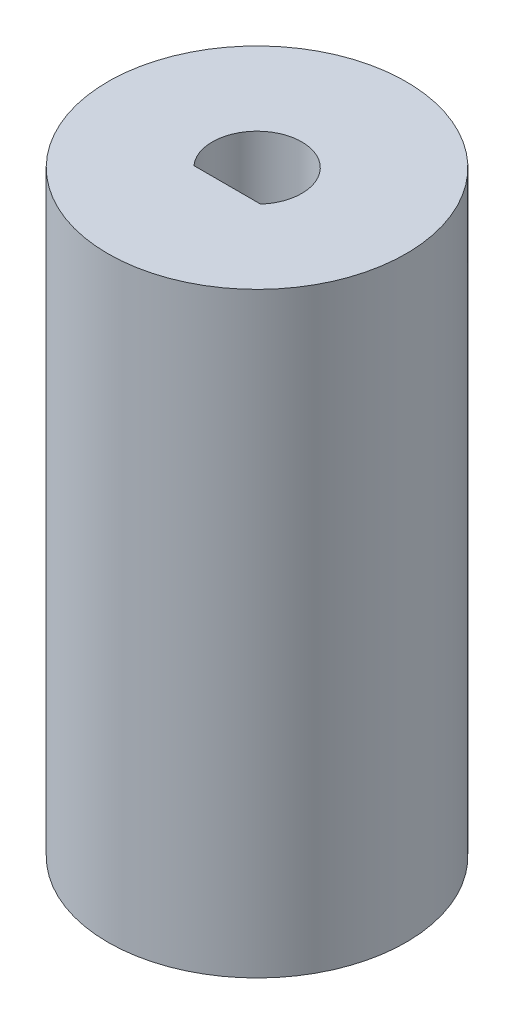
ISO-10303-21;
HEADER;
FILE_DESCRIPTION(('STEP AP214'),'2;1');
FILE_NAME('part.step','',(''),(''),'','','');
FILE_SCHEMA(('AUTOMOTIVE_DESIGN { 1 0 10303 214 1 1 1 1 }'));
ENDSEC;
DATA;
#1=APPLICATION_CONTEXT('core data for automotive mechanical design processes');
#2=APPLICATION_PROTOCOL_DEFINITION('international standard','automotive_design',2000,#1);
#3=PRODUCT_CONTEXT('',#1,'mechanical');
#4=PRODUCT('Part','Part','',(#3));
#5=PRODUCT_RELATED_PRODUCT_CATEGORY('part','',(#4));
#6=PRODUCT_DEFINITION_FORMATION('','',#4);
#7=PRODUCT_DEFINITION_CONTEXT('part definition',#1,'design');
#8=PRODUCT_DEFINITION('design','',#6,#7);
#9=PRODUCT_DEFINITION_SHAPE('','',#8);
#10=(LENGTH_UNIT() NAMED_UNIT(*) SI_UNIT(.MILLI.,.METRE.));
#11=(NAMED_UNIT(*) PLANE_ANGLE_UNIT() SI_UNIT($,.RADIAN.));
#12=(NAMED_UNIT(*) SI_UNIT($,.STERADIAN.) SOLID_ANGLE_UNIT());
#13=UNCERTAINTY_MEASURE_WITH_UNIT(LENGTH_MEASURE(1.E-05),#10,'distance_accuracy_value','');
#14=(GEOMETRIC_REPRESENTATION_CONTEXT(3) GLOBAL_UNCERTAINTY_ASSIGNED_CONTEXT((#13)) GLOBAL_UNIT_ASSIGNED_CONTEXT((#10,
#11,#12)) REPRESENTATION_CONTEXT('',''));
#15=CARTESIAN_POINT('',(0.,0.,0.));
#16=DIRECTION('',(0.,0.,1.));
#17=DIRECTION('',(1.,0.,0.));
#18=AXIS2_PLACEMENT_3D('',#15,#16,#17);
#19=CARTESIAN_POINT('',(0.,40.,0.));
#20=DIRECTION('',(0.,-1.,0.));
#21=DIRECTION('',(0.,0.,-1.));
#22=AXIS2_PLACEMENT_3D('',#19,#20,#21);
#23=CYLINDRICAL_SURFACE('',#22,10.);
#24=CARTESIAN_POINT('',(0.,40.,0.));
#25=DIRECTION('',(0.,1.,0.));
#26=DIRECTION('',(0.,0.,1.));
#27=AXIS2_PLACEMENT_3D('',#24,#25,#26);
#28=CIRCLE('',#27,10.);
#29=CARTESIAN_POINT('',(0.,40.,10.));
#30=VERTEX_POINT('',#29);
#31=EDGE_CURVE('E11',#30,#30,#28,.T.);
#32=ORIENTED_EDGE('',*,*,#31,.F.);
#33=EDGE_LOOP('',(#32));
#34=FACE_BOUND('',#33,.T.);
#35=CARTESIAN_POINT('',(0.,0.,0.));
#36=DIRECTION('',(0.,1.,0.));
#37=DIRECTION('',(0.,0.,1.));
#38=AXIS2_PLACEMENT_3D('',#35,#36,#37);
#39=CIRCLE('',#38,10.);
#40=CARTESIAN_POINT('',(0.,0.,10.));
#41=VERTEX_POINT('',#40);
#42=EDGE_CURVE('E35',#41,#41,#39,.T.);
#43=ORIENTED_EDGE('',*,*,#42,.T.);
#44=EDGE_LOOP('',(#43));
#45=FACE_BOUND('',#44,.T.);
#46=ADVANCED_FACE('F32',(#34,#45),#23,.T.);
#47=CARTESIAN_POINT('',(0.,40.,0.));
#48=DIRECTION('',(0.,1.,0.));
#49=DIRECTION('',(0.,0.,1.));
#50=AXIS2_PLACEMENT_3D('',#47,#48,#49);
#51=PLANE('',#50);
#52=CARTESIAN_POINT('',(1.80411241501588E-13,40.,0.));
#53=DIRECTION('',(0.,1.,0.));
#54=DIRECTION('',(0.,0.,1.));
#55=AXIS2_PLACEMENT_3D('',#52,#53,#54);
#56=CIRCLE('',#55,2.99999999999987);
#57=CARTESIAN_POINT('',(2.23606797749961,40.,2.));
#58=VERTEX_POINT('',#57);
#59=CARTESIAN_POINT('',(-2.23606797749961,40.,2.));
#60=VERTEX_POINT('',#59);
#61=EDGE_CURVE('E46',#58,#60,#56,.T.);
#62=ORIENTED_EDGE('',*,*,#61,.F.);
#63=DIRECTION('',(1.,0.,0.));
#64=VECTOR('',#63,1.);
#65=CARTESIAN_POINT('',(2.23606797749961,40.,2.));
#66=LINE('',#65,#64);
#67=EDGE_CURVE('E65',#60,#58,#66,.T.);
#68=ORIENTED_EDGE('',*,*,#67,.F.);
#69=EDGE_LOOP('',(#62,#68));
#70=FACE_BOUND('',#69,.T.);
#71=ORIENTED_EDGE('',*,*,#31,.T.);
#72=EDGE_LOOP('',(#71));
#73=FACE_BOUND('',#72,.T.);
#74=ADVANCED_FACE('F69',(#70,#73),#51,.T.);
#75=CARTESIAN_POINT('',(0.,0.,0.));
#76=DIRECTION('',(0.,1.,0.));
#77=DIRECTION('',(0.,0.,1.));
#78=AXIS2_PLACEMENT_3D('',#75,#76,#77);
#79=PLANE('',#78);
#80=ORIENTED_EDGE('',*,*,#42,.F.);
#81=EDGE_LOOP('',(#80));
#82=FACE_BOUND('',#81,.T.);
#83=ADVANCED_FACE('F89',(#82),#79,.F.);
#84=CARTESIAN_POINT('',(1.80411241501588E-13,30.,0.));
#85=DIRECTION('',(0.,1.,0.));
#86=DIRECTION('',(0.,0.,1.));
#87=AXIS2_PLACEMENT_3D('',#84,#85,#86);
#88=CYLINDRICAL_SURFACE('',#87,2.99999999999987);
#89=ORIENTED_EDGE('',*,*,#61,.T.);
#90=DIRECTION('',(0.,1.,0.));
#91=VECTOR('',#90,1.);
#92=CARTESIAN_POINT('',(-2.23606797749961,30.,2.));
#93=LINE('',#92,#91);
#94=CARTESIAN_POINT('',(-2.23606797749961,30.,2.));
#95=VERTEX_POINT('',#94);
#96=EDGE_CURVE('E62',#95,#60,#93,.T.);
#97=ORIENTED_EDGE('',*,*,#96,.F.);
#98=CARTESIAN_POINT('',(1.80411241501588E-13,30.,0.));
#99=DIRECTION('',(0.,1.,0.));
#100=DIRECTION('',(0.,0.,1.));
#101=AXIS2_PLACEMENT_3D('',#98,#99,#100);
#102=CIRCLE('',#101,2.99999999999987);
#103=CARTESIAN_POINT('',(2.23606797749961,30.,2.));
#104=VERTEX_POINT('',#103);
#105=EDGE_CURVE('E60',#104,#95,#102,.T.);
#106=ORIENTED_EDGE('',*,*,#105,.F.);
#107=DIRECTION('',(0.,1.,0.));
#108=VECTOR('',#107,1.);
#109=CARTESIAN_POINT('',(2.23606797749961,30.,2.));
#110=LINE('',#109,#108);
#111=EDGE_CURVE('E54',#104,#58,#110,.T.);
#112=ORIENTED_EDGE('',*,*,#111,.T.);
#113=EDGE_LOOP('',(#89,#97,#106,#112));
#114=FACE_BOUND('',#113,.T.);
#115=ADVANCED_FACE('F58',(#114),#88,.F.);
#116=CARTESIAN_POINT('',(2.23606797749961,30.,2.));
#117=DIRECTION('',(0.,0.,1.));
#118=DIRECTION('',(1.,0.,0.));
#119=AXIS2_PLACEMENT_3D('',#116,#117,#118);
#120=PLANE('',#119);
#121=ORIENTED_EDGE('',*,*,#67,.T.);
#122=ORIENTED_EDGE('',*,*,#111,.F.);
#123=DIRECTION('',(1.,0.,0.));
#124=VECTOR('',#123,1.);
#125=CARTESIAN_POINT('',(2.23606797749961,30.,2.));
#126=LINE('',#125,#124);
#127=EDGE_CURVE('E73',#95,#104,#126,.T.);
#128=ORIENTED_EDGE('',*,*,#127,.F.);
#129=ORIENTED_EDGE('',*,*,#96,.T.);
#130=EDGE_LOOP('',(#121,#122,#128,#129));
#131=FACE_BOUND('',#130,.T.);
#132=ADVANCED_FACE('F66',(#131),#120,.F.);
#133=CARTESIAN_POINT('',(1.80411241501588E-13,30.,0.));
#134=DIRECTION('',(0.,1.,0.));
#135=DIRECTION('',(0.,0.,1.));
#136=AXIS2_PLACEMENT_3D('',#133,#134,#135);
#137=PLANE('',#136);
#138=ORIENTED_EDGE('',*,*,#105,.T.);
#139=ORIENTED_EDGE('',*,*,#127,.T.);
#140=EDGE_LOOP('',(#138,#139));
#141=FACE_BOUND('',#140,.T.);
#142=ADVANCED_FACE('F77',(#141),#137,.T.);
#143=CLOSED_SHELL('',(#46,#74,#83,#115,#132,#142));
#144=MANIFOLD_SOLID_BREP('B2',#143);
#145=ADVANCED_BREP_SHAPE_REPRESENTATION('',(#18,#144),#14);
#146=SHAPE_DEFINITION_REPRESENTATION(#9,#145);
ENDSEC;
END-ISO-10303-21;
